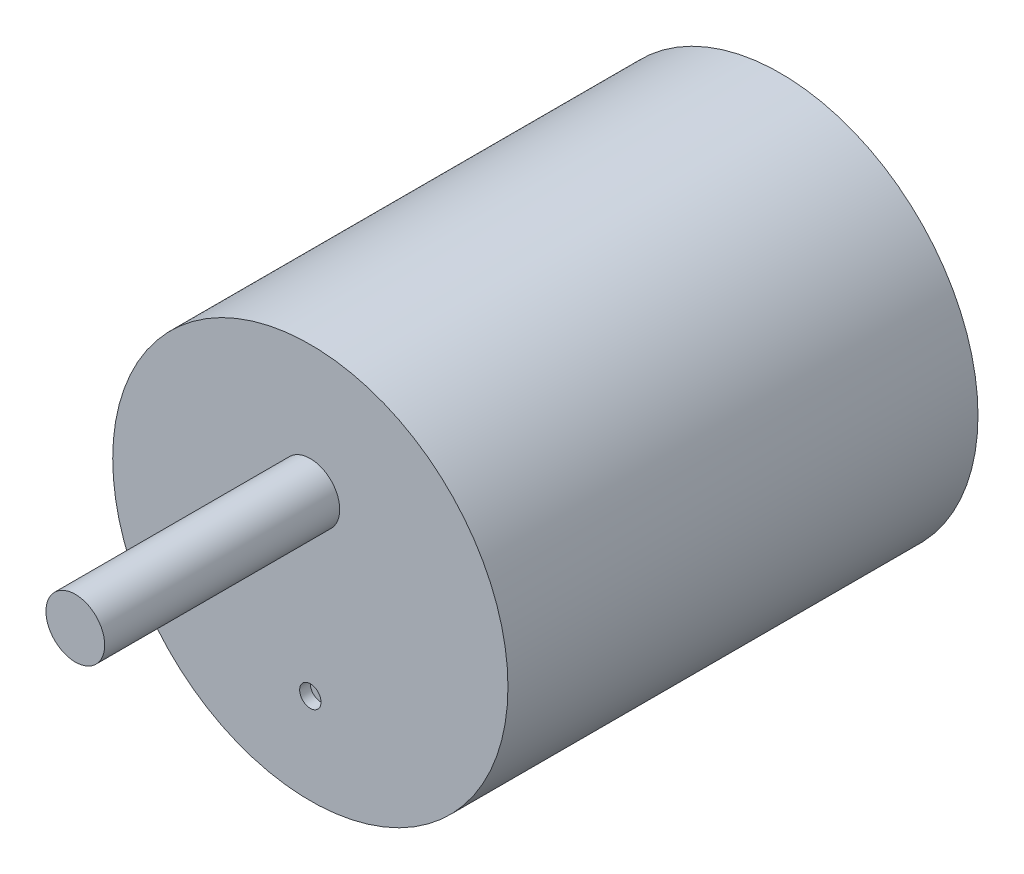
ISO-10303-21;
HEADER;
FILE_DESCRIPTION(('STEP AP214'),'2;1');
FILE_NAME('part.step','',(''),(''),'','','');
FILE_SCHEMA(('AUTOMOTIVE_DESIGN { 1 0 10303 214 1 1 1 1 }'));
ENDSEC;
DATA;
#1=APPLICATION_CONTEXT('core data for automotive mechanical design processes');
#2=APPLICATION_PROTOCOL_DEFINITION('international standard','automotive_design',2000,#1);
#3=PRODUCT_CONTEXT('',#1,'mechanical');
#4=PRODUCT('Part','Part','',(#3));
#5=PRODUCT_RELATED_PRODUCT_CATEGORY('part','',(#4));
#6=PRODUCT_DEFINITION_FORMATION('','',#4);
#7=PRODUCT_DEFINITION_CONTEXT('part definition',#1,'design');
#8=PRODUCT_DEFINITION('design','',#6,#7);
#9=PRODUCT_DEFINITION_SHAPE('','',#8);
#10=(LENGTH_UNIT() NAMED_UNIT(*) SI_UNIT(.MILLI.,.METRE.));
#11=(NAMED_UNIT(*) PLANE_ANGLE_UNIT() SI_UNIT($,.RADIAN.));
#12=(NAMED_UNIT(*) SI_UNIT($,.STERADIAN.) SOLID_ANGLE_UNIT());
#13=UNCERTAINTY_MEASURE_WITH_UNIT(LENGTH_MEASURE(1.E-05),#10,'distance_accuracy_value','');
#14=(GEOMETRIC_REPRESENTATION_CONTEXT(3) GLOBAL_UNCERTAINTY_ASSIGNED_CONTEXT((#13)) GLOBAL_UNIT_ASSIGNED_CONTEXT((#10,
#11,#12)) REPRESENTATION_CONTEXT('',''));
#15=CARTESIAN_POINT('',(0.,0.,0.));
#16=DIRECTION('',(0.,0.,1.));
#17=DIRECTION('',(1.,0.,0.));
#18=AXIS2_PLACEMENT_3D('',#15,#16,#17);
#19=CARTESIAN_POINT('',(0.,0.,44.));
#20=DIRECTION('',(0.,0.,-1.));
#21=DIRECTION('',(-1.,0.,0.));
#22=AXIS2_PLACEMENT_3D('',#19,#20,#21);
#23=CYLINDRICAL_SURFACE('',#22,18.5);
#24=CARTESIAN_POINT('',(0.,0.,44.));
#25=DIRECTION('',(0.,0.,1.));
#26=DIRECTION('',(1.,0.,0.));
#27=AXIS2_PLACEMENT_3D('',#24,#25,#26);
#28=CIRCLE('',#27,18.5);
#29=CARTESIAN_POINT('',(18.5,0.,44.));
#30=VERTEX_POINT('',#29);
#31=EDGE_CURVE('E10',#30,#30,#28,.T.);
#32=ORIENTED_EDGE('',*,*,#31,.F.);
#33=EDGE_LOOP('',(#32));
#34=FACE_BOUND('',#33,.T.);
#35=CARTESIAN_POINT('',(0.,0.,0.));
#36=DIRECTION('',(0.,0.,1.));
#37=DIRECTION('',(1.,0.,0.));
#38=AXIS2_PLACEMENT_3D('',#35,#36,#37);
#39=CIRCLE('',#38,18.5);
#40=CARTESIAN_POINT('',(18.5,0.,0.));
#41=VERTEX_POINT('',#40);
#42=EDGE_CURVE('E38',#41,#41,#39,.T.);
#43=ORIENTED_EDGE('',*,*,#42,.T.);
#44=EDGE_LOOP('',(#43));
#45=FACE_BOUND('',#44,.T.);
#46=ADVANCED_FACE('F35',(#34,#45),#23,.T.);
#47=CARTESIAN_POINT('',(0.,0.,44.));
#48=DIRECTION('',(0.,0.,1.));
#49=DIRECTION('',(1.,0.,0.));
#50=AXIS2_PLACEMENT_3D('',#47,#48,#49);
#51=PLANE('',#50);
#52=CARTESIAN_POINT('',(0.,-10.,44.));
#53=DIRECTION('',(0.,0.,1.));
#54=DIRECTION('',(1.,0.,0.));
#55=AXIS2_PLACEMENT_3D('',#52,#53,#54);
#56=CIRCLE('',#55,1.);
#57=CARTESIAN_POINT('',(1.,-10.,44.));
#58=VERTEX_POINT('',#57);
#59=EDGE_CURVE('E53',#58,#58,#56,.T.);
#60=ORIENTED_EDGE('',*,*,#59,.F.);
#61=EDGE_LOOP('',(#60));
#62=FACE_BOUND('',#61,.T.);
#63=CARTESIAN_POINT('',(0.,6.5,44.));
#64=DIRECTION('',(0.,0.,1.));
#65=DIRECTION('',(1.,0.,0.));
#66=AXIS2_PLACEMENT_3D('',#63,#64,#65);
#67=CIRCLE('',#66,2.75);
#68=CARTESIAN_POINT('',(2.75,6.5,44.));
#69=VERTEX_POINT('',#68);
#70=EDGE_CURVE('E47',#69,#69,#67,.T.);
#71=ORIENTED_EDGE('',*,*,#70,.F.);
#72=EDGE_LOOP('',(#71));
#73=FACE_BOUND('',#72,.T.);
#74=ORIENTED_EDGE('',*,*,#31,.T.);
#75=EDGE_LOOP('',(#74));
#76=FACE_BOUND('',#75,.T.);
#77=ADVANCED_FACE('F68',(#62,#73,#76),#51,.T.);
#78=CARTESIAN_POINT('',(0.,0.,0.));
#79=DIRECTION('',(0.,0.,1.));
#80=DIRECTION('',(1.,0.,0.));
#81=AXIS2_PLACEMENT_3D('',#78,#79,#80);
#82=PLANE('',#81);
#83=ORIENTED_EDGE('',*,*,#42,.F.);
#84=EDGE_LOOP('',(#83));
#85=FACE_BOUND('',#84,.T.);
#86=ADVANCED_FACE('F71',(#85),#82,.F.);
#87=CARTESIAN_POINT('',(0.,6.5,66.));
#88=DIRECTION('',(0.,0.,-1.));
#89=DIRECTION('',(-1.,0.,0.));
#90=AXIS2_PLACEMENT_3D('',#87,#88,#89);
#91=CYLINDRICAL_SURFACE('',#90,2.75);
#92=CARTESIAN_POINT('',(0.,6.5,66.));
#93=DIRECTION('',(0.,0.,1.));
#94=DIRECTION('',(1.,0.,0.));
#95=AXIS2_PLACEMENT_3D('',#92,#93,#94);
#96=CIRCLE('',#95,2.75);
#97=CARTESIAN_POINT('',(2.75,6.5,66.));
#98=VERTEX_POINT('',#97);
#99=EDGE_CURVE('E45',#98,#98,#96,.T.);
#100=ORIENTED_EDGE('',*,*,#99,.F.);
#101=EDGE_LOOP('',(#100));
#102=FACE_BOUND('',#101,.T.);
#103=ORIENTED_EDGE('',*,*,#70,.T.);
#104=EDGE_LOOP('',(#103));
#105=FACE_BOUND('',#104,.T.);
#106=ADVANCED_FACE('F75',(#102,#105),#91,.T.);
#107=CARTESIAN_POINT('',(0.,6.5,66.));
#108=DIRECTION('',(0.,0.,1.));
#109=DIRECTION('',(1.,0.,0.));
#110=AXIS2_PLACEMENT_3D('',#107,#108,#109);
#111=PLANE('',#110);
#112=ORIENTED_EDGE('',*,*,#99,.T.);
#113=EDGE_LOOP('',(#112));
#114=FACE_BOUND('',#113,.T.);
#115=ADVANCED_FACE('F64',(#114),#111,.T.);
#116=CARTESIAN_POINT('',(0.,-10.,43.));
#117=DIRECTION('',(0.,0.,1.));
#118=DIRECTION('',(1.,0.,0.));
#119=AXIS2_PLACEMENT_3D('',#116,#117,#118);
#120=CYLINDRICAL_SURFACE('',#119,1.);
#121=CARTESIAN_POINT('',(0.,-10.,43.));
#122=DIRECTION('',(0.,0.,1.));
#123=DIRECTION('',(1.,0.,0.));
#124=AXIS2_PLACEMENT_3D('',#121,#122,#123);
#125=CIRCLE('',#124,1.);
#126=CARTESIAN_POINT('',(1.,-10.,43.));
#127=VERTEX_POINT('',#126);
#128=EDGE_CURVE('E50',#127,#127,#125,.T.);
#129=ORIENTED_EDGE('',*,*,#128,.F.);
#130=EDGE_LOOP('',(#129));
#131=FACE_BOUND('',#130,.T.);
#132=ORIENTED_EDGE('',*,*,#59,.T.);
#133=EDGE_LOOP('',(#132));
#134=FACE_BOUND('',#133,.T.);
#135=ADVANCED_FACE('F61',(#131,#134),#120,.F.);
#136=CARTESIAN_POINT('',(0.,-10.,43.));
#137=DIRECTION('',(0.,0.,1.));
#138=DIRECTION('',(1.,0.,0.));
#139=AXIS2_PLACEMENT_3D('',#136,#137,#138);
#140=PLANE('',#139);
#141=ORIENTED_EDGE('',*,*,#128,.T.);
#142=EDGE_LOOP('',(#141));
#143=FACE_BOUND('',#142,.T.);
#144=ADVANCED_FACE('F59',(#143),#140,.T.);
#145=CLOSED_SHELL('',(#46,#77,#86,#106,#115,#135,#144));
#146=MANIFOLD_SOLID_BREP('B2',#145);
#147=ADVANCED_BREP_SHAPE_REPRESENTATION('',(#18,#146),#14);
#148=SHAPE_DEFINITION_REPRESENTATION(#9,#147);
ENDSEC;
END-ISO-10303-21;
